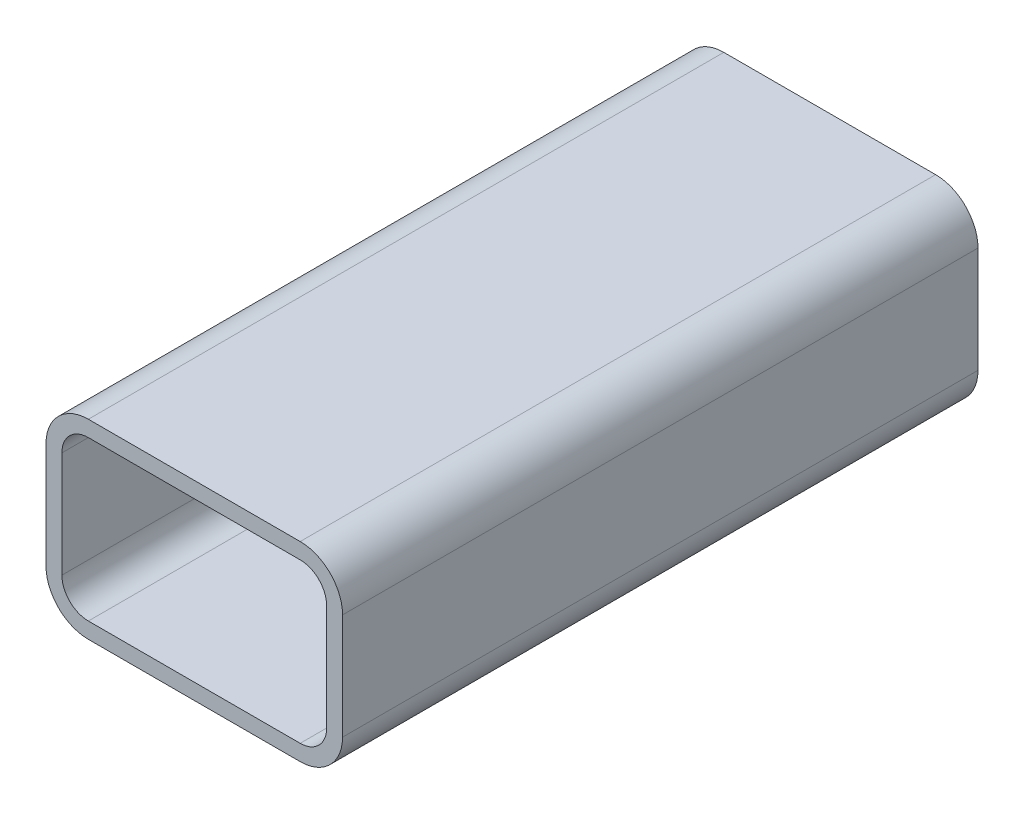
ISO-10303-21;
HEADER;
FILE_DESCRIPTION(('STEP AP214'),'2;1');
FILE_NAME('part.step','',(''),(''),'','','');
FILE_SCHEMA(('AUTOMOTIVE_DESIGN { 1 0 10303 214 1 1 1 1 }'));
ENDSEC;
DATA;
#1=APPLICATION_CONTEXT('core data for automotive mechanical design processes');
#2=APPLICATION_PROTOCOL_DEFINITION('international standard','automotive_design',2000,#1);
#3=PRODUCT_CONTEXT('',#1,'mechanical');
#4=PRODUCT('Part','Part','',(#3));
#5=PRODUCT_RELATED_PRODUCT_CATEGORY('part','',(#4));
#6=PRODUCT_DEFINITION_FORMATION('','',#4);
#7=PRODUCT_DEFINITION_CONTEXT('part definition',#1,'design');
#8=PRODUCT_DEFINITION('design','',#6,#7);
#9=PRODUCT_DEFINITION_SHAPE('','',#8);
#10=(LENGTH_UNIT() NAMED_UNIT(*) SI_UNIT(.MILLI.,.METRE.));
#11=(NAMED_UNIT(*) PLANE_ANGLE_UNIT() SI_UNIT($,.RADIAN.));
#12=(NAMED_UNIT(*) SI_UNIT($,.STERADIAN.) SOLID_ANGLE_UNIT());
#13=UNCERTAINTY_MEASURE_WITH_UNIT(LENGTH_MEASURE(1.E-05),#10,'distance_accuracy_value','');
#14=(GEOMETRIC_REPRESENTATION_CONTEXT(3) GLOBAL_UNCERTAINTY_ASSIGNED_CONTEXT((#13)) GLOBAL_UNIT_ASSIGNED_CONTEXT((#10,
#11,#12)) REPRESENTATION_CONTEXT('',''));
#15=CARTESIAN_POINT('',(0.,0.,0.));
#16=DIRECTION('',(0.,0.,1.));
#17=DIRECTION('',(1.,0.,0.));
#18=AXIS2_PLACEMENT_3D('',#15,#16,#17);
#19=CARTESIAN_POINT('',(20.,10.,60.));
#20=DIRECTION('',(0.,0.,-1.));
#21=DIRECTION('',(-1.,0.,0.));
#22=AXIS2_PLACEMENT_3D('',#19,#20,#21);
#23=PLANE('',#22);
#24=CARTESIAN_POINT('',(20.,10.,60.));
#25=DIRECTION('',(0.,0.,-1.));
#26=DIRECTION('',(-1.,0.,0.));
#27=AXIS2_PLACEMENT_3D('',#24,#25,#26);
#28=CIRCLE('',#27,8.);
#29=CARTESIAN_POINT('',(28.,10.,60.));
#30=VERTEX_POINT('',#29);
#31=CARTESIAN_POINT('',(20.,18.,60.));
#32=VERTEX_POINT('',#31);
#33=EDGE_CURVE('E290',#30,#32,#28,.F.);
#34=ORIENTED_EDGE('',*,*,#33,.T.);
#35=DIRECTION('',(-1.,0.,0.));
#36=VECTOR('',#35,1.);
#37=CARTESIAN_POINT('',(20.,18.,60.));
#38=LINE('',#37,#36);
#39=CARTESIAN_POINT('',(-20.,18.,60.));
#40=VERTEX_POINT('',#39);
#41=EDGE_CURVE('E294',#32,#40,#38,.T.);
#42=ORIENTED_EDGE('',*,*,#41,.T.);
#43=CARTESIAN_POINT('',(-20.,10.,60.));
#44=DIRECTION('',(0.,0.,-1.));
#45=DIRECTION('',(-1.,0.,0.));
#46=AXIS2_PLACEMENT_3D('',#43,#44,#45);
#47=CIRCLE('',#46,8.);
#48=CARTESIAN_POINT('',(-28.,10.,60.));
#49=VERTEX_POINT('',#48);
#50=EDGE_CURVE('E298',#40,#49,#47,.F.);
#51=ORIENTED_EDGE('',*,*,#50,.T.);
#52=DIRECTION('',(0.,-1.,0.));
#53=VECTOR('',#52,1.);
#54=CARTESIAN_POINT('',(-28.,9.99999999999998,60.));
#55=LINE('',#54,#53);
#56=CARTESIAN_POINT('',(-28.,-10.,60.));
#57=VERTEX_POINT('',#56);
#58=EDGE_CURVE('E301',#49,#57,#55,.T.);
#59=ORIENTED_EDGE('',*,*,#58,.T.);
#60=CARTESIAN_POINT('',(-20.,-9.99999999999999,60.));
#61=DIRECTION('',(0.,0.,-1.));
#62=DIRECTION('',(-1.,0.,0.));
#63=AXIS2_PLACEMENT_3D('',#60,#61,#62);
#64=CIRCLE('',#63,8.);
#65=CARTESIAN_POINT('',(-20.,-18.,60.));
#66=VERTEX_POINT('',#65);
#67=EDGE_CURVE('E304',#57,#66,#64,.F.);
#68=ORIENTED_EDGE('',*,*,#67,.T.);
#69=DIRECTION('',(1.,0.,0.));
#70=VECTOR('',#69,1.);
#71=CARTESIAN_POINT('',(20.,-18.,60.));
#72=LINE('',#71,#70);
#73=CARTESIAN_POINT('',(20.,-18.,60.));
#74=VERTEX_POINT('',#73);
#75=EDGE_CURVE('E307',#66,#74,#72,.T.);
#76=ORIENTED_EDGE('',*,*,#75,.T.);
#77=CARTESIAN_POINT('',(20.,-9.99999999999999,60.));
#78=DIRECTION('',(0.,0.,-1.));
#79=DIRECTION('',(-1.,0.,0.));
#80=AXIS2_PLACEMENT_3D('',#77,#78,#79);
#81=CIRCLE('',#80,8.);
#82=CARTESIAN_POINT('',(28.,-9.99999999999999,60.));
#83=VERTEX_POINT('',#82);
#84=EDGE_CURVE('E310',#74,#83,#81,.F.);
#85=ORIENTED_EDGE('',*,*,#84,.T.);
#86=DIRECTION('',(0.,1.,0.));
#87=VECTOR('',#86,1.);
#88=CARTESIAN_POINT('',(28.,10.,60.));
#89=LINE('',#88,#87);
#90=EDGE_CURVE('E313',#83,#30,#89,.T.);
#91=ORIENTED_EDGE('',*,*,#90,.T.);
#92=EDGE_LOOP('',(#34,#42,#51,#59,#68,#76,#85,#91));
#93=FACE_BOUND('',#92,.T.);
#94=CARTESIAN_POINT('',(20.,10.,60.));
#95=DIRECTION('',(0.,0.,1.));
#96=DIRECTION('',(-1.,0.,0.));
#97=AXIS2_PLACEMENT_3D('',#94,#95,#96);
#98=CIRCLE('',#97,5.);
#99=CARTESIAN_POINT('',(25.,10.,60.));
#100=VERTEX_POINT('',#99);
#101=CARTESIAN_POINT('',(20.,15.,60.));
#102=VERTEX_POINT('',#101);
#103=EDGE_CURVE('E201',#100,#102,#98,.T.);
#104=ORIENTED_EDGE('',*,*,#103,.F.);
#105=DIRECTION('',(0.,1.,0.));
#106=VECTOR('',#105,1.);
#107=CARTESIAN_POINT('',(25.,10.,60.));
#108=LINE('',#107,#106);
#109=CARTESIAN_POINT('',(25.,-9.99999999999999,60.));
#110=VERTEX_POINT('',#109);
#111=EDGE_CURVE('E242',#110,#100,#108,.T.);
#112=ORIENTED_EDGE('',*,*,#111,.F.);
#113=CARTESIAN_POINT('',(20.,-9.99999999999999,60.));
#114=DIRECTION('',(0.,0.,1.));
#115=DIRECTION('',(-1.,0.,0.));
#116=AXIS2_PLACEMENT_3D('',#113,#114,#115);
#117=CIRCLE('',#116,5.);
#118=CARTESIAN_POINT('',(20.,-15.,60.));
#119=VERTEX_POINT('',#118);
#120=EDGE_CURVE('E239',#119,#110,#117,.T.);
#121=ORIENTED_EDGE('',*,*,#120,.F.);
#122=DIRECTION('',(1.,0.,0.));
#123=VECTOR('',#122,1.);
#124=CARTESIAN_POINT('',(-20.,-15.,60.));
#125=LINE('',#124,#123);
#126=CARTESIAN_POINT('',(-20.,-15.,60.));
#127=VERTEX_POINT('',#126);
#128=EDGE_CURVE('E236',#127,#119,#125,.T.);
#129=ORIENTED_EDGE('',*,*,#128,.F.);
#130=CARTESIAN_POINT('',(-20.,-9.99999999999999,60.));
#131=DIRECTION('',(0.,0.,1.));
#132=DIRECTION('',(-1.,0.,0.));
#133=AXIS2_PLACEMENT_3D('',#130,#131,#132);
#134=CIRCLE('',#133,5.);
#135=CARTESIAN_POINT('',(-25.,-9.99999999999999,60.));
#136=VERTEX_POINT('',#135);
#137=EDGE_CURVE('E233',#136,#127,#134,.T.);
#138=ORIENTED_EDGE('',*,*,#137,.F.);
#139=DIRECTION('',(0.,-1.,0.));
#140=VECTOR('',#139,1.);
#141=CARTESIAN_POINT('',(-25.,10.,60.));
#142=LINE('',#141,#140);
#143=CARTESIAN_POINT('',(-25.,10.,60.));
#144=VERTEX_POINT('',#143);
#145=EDGE_CURVE('E228',#144,#136,#142,.T.);
#146=ORIENTED_EDGE('',*,*,#145,.F.);
#147=CARTESIAN_POINT('',(-20.,10.,60.));
#148=DIRECTION('',(0.,0.,1.));
#149=DIRECTION('',(-1.,0.,0.));
#150=AXIS2_PLACEMENT_3D('',#147,#148,#149);
#151=CIRCLE('',#150,5.);
#152=CARTESIAN_POINT('',(-20.,15.,60.));
#153=VERTEX_POINT('',#152);
#154=EDGE_CURVE('E224',#153,#144,#151,.T.);
#155=ORIENTED_EDGE('',*,*,#154,.F.);
#156=DIRECTION('',(-1.,0.,0.));
#157=VECTOR('',#156,1.);
#158=CARTESIAN_POINT('',(-20.,15.,60.));
#159=LINE('',#158,#157);
#160=EDGE_CURVE('E210',#102,#153,#159,.T.);
#161=ORIENTED_EDGE('',*,*,#160,.F.);
#162=EDGE_LOOP('',(#104,#112,#121,#129,#138,#146,#155,#161));
#163=FACE_BOUND('',#162,.T.);
#164=ADVANCED_FACE('F87',(#93,#163),#23,.F.);
#165=CARTESIAN_POINT('',(20.,10.,-60.));
#166=DIRECTION('',(0.,0.,-1.));
#167=DIRECTION('',(-1.,0.,0.));
#168=AXIS2_PLACEMENT_3D('',#165,#166,#167);
#169=PLANE('',#168);
#170=CARTESIAN_POINT('',(20.,10.,-60.));
#171=DIRECTION('',(0.,0.,-1.));
#172=DIRECTION('',(-1.,0.,0.));
#173=AXIS2_PLACEMENT_3D('',#170,#171,#172);
#174=CIRCLE('',#173,8.);
#175=CARTESIAN_POINT('',(28.,10.,-60.));
#176=VERTEX_POINT('',#175);
#177=CARTESIAN_POINT('',(20.,18.,-60.));
#178=VERTEX_POINT('',#177);
#179=EDGE_CURVE('E219',#176,#178,#174,.F.);
#180=ORIENTED_EDGE('',*,*,#179,.F.);
#181=DIRECTION('',(0.,1.,0.));
#182=VECTOR('',#181,1.);
#183=CARTESIAN_POINT('',(28.,10.,-60.));
#184=LINE('',#183,#182);
#185=CARTESIAN_POINT('',(28.,-9.99999999999999,-60.));
#186=VERTEX_POINT('',#185);
#187=EDGE_CURVE('E295',#186,#176,#184,.T.);
#188=ORIENTED_EDGE('',*,*,#187,.F.);
#189=CARTESIAN_POINT('',(20.,-9.99999999999999,-60.));
#190=DIRECTION('',(0.,0.,-1.));
#191=DIRECTION('',(-1.,0.,0.));
#192=AXIS2_PLACEMENT_3D('',#189,#190,#191);
#193=CIRCLE('',#192,8.);
#194=CARTESIAN_POINT('',(20.,-18.,-60.));
#195=VERTEX_POINT('',#194);
#196=EDGE_CURVE('E335',#195,#186,#193,.F.);
#197=ORIENTED_EDGE('',*,*,#196,.F.);
#198=DIRECTION('',(1.,0.,0.));
#199=VECTOR('',#198,1.);
#200=CARTESIAN_POINT('',(20.,-18.,-60.));
#201=LINE('',#200,#199);
#202=CARTESIAN_POINT('',(-20.,-18.,-60.));
#203=VERTEX_POINT('',#202);
#204=EDGE_CURVE('E332',#203,#195,#201,.T.);
#205=ORIENTED_EDGE('',*,*,#204,.F.);
#206=CARTESIAN_POINT('',(-20.,-9.99999999999999,-60.));
#207=DIRECTION('',(0.,0.,-1.));
#208=DIRECTION('',(-1.,0.,0.));
#209=AXIS2_PLACEMENT_3D('',#206,#207,#208);
#210=CIRCLE('',#209,8.);
#211=CARTESIAN_POINT('',(-28.,-10.,-60.));
#212=VERTEX_POINT('',#211);
#213=EDGE_CURVE('E329',#212,#203,#210,.F.);
#214=ORIENTED_EDGE('',*,*,#213,.F.);
#215=DIRECTION('',(0.,-1.,0.));
#216=VECTOR('',#215,1.);
#217=CARTESIAN_POINT('',(-28.,9.99999999999998,-60.));
#218=LINE('',#217,#216);
#219=CARTESIAN_POINT('',(-28.,10.,-60.));
#220=VERTEX_POINT('',#219);
#221=EDGE_CURVE('E326',#220,#212,#218,.T.);
#222=ORIENTED_EDGE('',*,*,#221,.F.);
#223=CARTESIAN_POINT('',(-20.,10.,-60.));
#224=DIRECTION('',(0.,0.,-1.));
#225=DIRECTION('',(-1.,0.,0.));
#226=AXIS2_PLACEMENT_3D('',#223,#224,#225);
#227=CIRCLE('',#226,8.);
#228=CARTESIAN_POINT('',(-20.,18.,-60.));
#229=VERTEX_POINT('',#228);
#230=EDGE_CURVE('E323',#229,#220,#227,.F.);
#231=ORIENTED_EDGE('',*,*,#230,.F.);
#232=DIRECTION('',(-1.,0.,0.));
#233=VECTOR('',#232,1.);
#234=CARTESIAN_POINT('',(20.,18.,-60.));
#235=LINE('',#234,#233);
#236=EDGE_CURVE('E320',#178,#229,#235,.T.);
#237=ORIENTED_EDGE('',*,*,#236,.F.);
#238=EDGE_LOOP('',(#180,#188,#197,#205,#214,#222,#231,#237));
#239=FACE_BOUND('',#238,.T.);
#240=DIRECTION('',(0.,1.,0.));
#241=VECTOR('',#240,1.);
#242=CARTESIAN_POINT('',(25.,10.,-60.));
#243=LINE('',#242,#241);
#244=CARTESIAN_POINT('',(25.,-9.99999999999999,-60.));
#245=VERTEX_POINT('',#244);
#246=CARTESIAN_POINT('',(25.,10.,-60.));
#247=VERTEX_POINT('',#246);
#248=EDGE_CURVE('E211',#245,#247,#243,.T.);
#249=ORIENTED_EDGE('',*,*,#248,.T.);
#250=CARTESIAN_POINT('',(20.,10.,-60.));
#251=DIRECTION('',(0.,0.,1.));
#252=DIRECTION('',(-1.,0.,0.));
#253=AXIS2_PLACEMENT_3D('',#250,#251,#252);
#254=CIRCLE('',#253,5.);
#255=CARTESIAN_POINT('',(20.,15.,-60.));
#256=VERTEX_POINT('',#255);
#257=EDGE_CURVE('E111',#247,#256,#254,.T.);
#258=ORIENTED_EDGE('',*,*,#257,.T.);
#259=DIRECTION('',(-1.,0.,0.));
#260=VECTOR('',#259,1.);
#261=CARTESIAN_POINT('',(-20.,15.,-60.));
#262=LINE('',#261,#260);
#263=CARTESIAN_POINT('',(-20.,15.,-60.));
#264=VERTEX_POINT('',#263);
#265=EDGE_CURVE('E217',#256,#264,#262,.T.);
#266=ORIENTED_EDGE('',*,*,#265,.T.);
#267=CARTESIAN_POINT('',(-20.,10.,-60.));
#268=DIRECTION('',(0.,0.,1.));
#269=DIRECTION('',(-1.,0.,0.));
#270=AXIS2_PLACEMENT_3D('',#267,#268,#269);
#271=CIRCLE('',#270,5.);
#272=CARTESIAN_POINT('',(-25.,10.,-60.));
#273=VERTEX_POINT('',#272);
#274=EDGE_CURVE('E249',#264,#273,#271,.T.);
#275=ORIENTED_EDGE('',*,*,#274,.T.);
#276=DIRECTION('',(0.,-1.,0.));
#277=VECTOR('',#276,1.);
#278=CARTESIAN_POINT('',(-25.,10.,-60.));
#279=LINE('',#278,#277);
#280=CARTESIAN_POINT('',(-25.,-9.99999999999999,-60.));
#281=VERTEX_POINT('',#280);
#282=EDGE_CURVE('E253',#273,#281,#279,.T.);
#283=ORIENTED_EDGE('',*,*,#282,.T.);
#284=CARTESIAN_POINT('',(-20.,-9.99999999999999,-60.));
#285=DIRECTION('',(0.,0.,1.));
#286=DIRECTION('',(-1.,0.,0.));
#287=AXIS2_PLACEMENT_3D('',#284,#285,#286);
#288=CIRCLE('',#287,5.);
#289=CARTESIAN_POINT('',(-20.,-15.,-60.));
#290=VERTEX_POINT('',#289);
#291=EDGE_CURVE('E257',#281,#290,#288,.T.);
#292=ORIENTED_EDGE('',*,*,#291,.T.);
#293=DIRECTION('',(1.,0.,0.));
#294=VECTOR('',#293,1.);
#295=CARTESIAN_POINT('',(-20.,-15.,-60.));
#296=LINE('',#295,#294);
#297=CARTESIAN_POINT('',(20.,-15.,-60.));
#298=VERTEX_POINT('',#297);
#299=EDGE_CURVE('E261',#290,#298,#296,.T.);
#300=ORIENTED_EDGE('',*,*,#299,.T.);
#301=CARTESIAN_POINT('',(20.,-9.99999999999999,-60.));
#302=DIRECTION('',(0.,0.,1.));
#303=DIRECTION('',(-1.,0.,0.));
#304=AXIS2_PLACEMENT_3D('',#301,#302,#303);
#305=CIRCLE('',#304,5.);
#306=EDGE_CURVE('E265',#298,#245,#305,.T.);
#307=ORIENTED_EDGE('',*,*,#306,.T.);
#308=EDGE_LOOP('',(#249,#258,#266,#275,#283,#292,#300,#307));
#309=FACE_BOUND('',#308,.T.);
#310=ADVANCED_FACE('F374',(#239,#309),#169,.T.);
#311=CARTESIAN_POINT('',(20.,10.,60.));
#312=DIRECTION('',(0.,0.,-1.));
#313=DIRECTION('',(-1.,0.,0.));
#314=AXIS2_PLACEMENT_3D('',#311,#312,#313);
#315=CYLINDRICAL_SURFACE('',#314,8.);
#316=ORIENTED_EDGE('',*,*,#179,.T.);
#317=DIRECTION('',(0.,0.,-1.));
#318=VECTOR('',#317,1.);
#319=CARTESIAN_POINT('',(20.,18.,60.));
#320=LINE('',#319,#318);
#321=EDGE_CURVE('E12',#32,#178,#320,.T.);
#322=ORIENTED_EDGE('',*,*,#321,.F.);
#323=ORIENTED_EDGE('',*,*,#33,.F.);
#324=DIRECTION('',(0.,0.,-1.));
#325=VECTOR('',#324,1.);
#326=CARTESIAN_POINT('',(28.,10.,60.));
#327=LINE('',#326,#325);
#328=EDGE_CURVE('E316',#30,#176,#327,.T.);
#329=ORIENTED_EDGE('',*,*,#328,.T.);
#330=EDGE_LOOP('',(#316,#322,#323,#329));
#331=FACE_BOUND('',#330,.T.);
#332=ADVANCED_FACE('F89',(#331),#315,.T.);
#333=CARTESIAN_POINT('',(20.,18.,60.));
#334=DIRECTION('',(0.,-1.,0.));
#335=DIRECTION('',(0.,0.,-1.));
#336=AXIS2_PLACEMENT_3D('',#333,#334,#335);
#337=PLANE('',#336);
#338=ORIENTED_EDGE('',*,*,#236,.T.);
#339=DIRECTION('',(0.,0.,-1.));
#340=VECTOR('',#339,1.);
#341=CARTESIAN_POINT('',(-20.,18.,60.));
#342=LINE('',#341,#340);
#343=EDGE_CURVE('E96',#40,#229,#342,.T.);
#344=ORIENTED_EDGE('',*,*,#343,.F.);
#345=ORIENTED_EDGE('',*,*,#41,.F.);
#346=ORIENTED_EDGE('',*,*,#321,.T.);
#347=EDGE_LOOP('',(#338,#344,#345,#346));
#348=FACE_BOUND('',#347,.T.);
#349=ADVANCED_FACE('F391',(#348),#337,.F.);
#350=CARTESIAN_POINT('',(-20.,10.,60.));
#351=DIRECTION('',(0.,0.,-1.));
#352=DIRECTION('',(-1.,0.,0.));
#353=AXIS2_PLACEMENT_3D('',#350,#351,#352);
#354=CYLINDRICAL_SURFACE('',#353,8.);
#355=ORIENTED_EDGE('',*,*,#230,.T.);
#356=DIRECTION('',(0.,0.,-1.));
#357=VECTOR('',#356,1.);
#358=CARTESIAN_POINT('',(-28.,10.,60.));
#359=LINE('',#358,#357);
#360=EDGE_CURVE('E359',#49,#220,#359,.T.);
#361=ORIENTED_EDGE('',*,*,#360,.F.);
#362=ORIENTED_EDGE('',*,*,#50,.F.);
#363=ORIENTED_EDGE('',*,*,#343,.T.);
#364=EDGE_LOOP('',(#355,#361,#362,#363));
#365=FACE_BOUND('',#364,.T.);
#366=ADVANCED_FACE('F368',(#365),#354,.T.);
#367=CARTESIAN_POINT('',(-28.,9.99999999999998,60.));
#368=DIRECTION('',(1.,0.,0.));
#369=DIRECTION('',(0.,1.,0.));
#370=AXIS2_PLACEMENT_3D('',#367,#368,#369);
#371=PLANE('',#370);
#372=ORIENTED_EDGE('',*,*,#221,.T.);
#373=DIRECTION('',(0.,0.,-1.));
#374=VECTOR('',#373,1.);
#375=CARTESIAN_POINT('',(-28.,-10.,60.));
#376=LINE('',#375,#374);
#377=EDGE_CURVE('E355',#57,#212,#376,.T.);
#378=ORIENTED_EDGE('',*,*,#377,.F.);
#379=ORIENTED_EDGE('',*,*,#58,.F.);
#380=ORIENTED_EDGE('',*,*,#360,.T.);
#381=EDGE_LOOP('',(#372,#378,#379,#380));
#382=FACE_BOUND('',#381,.T.);
#383=ADVANCED_FACE('F380',(#382),#371,.F.);
#384=CARTESIAN_POINT('',(-20.,-9.99999999999999,60.));
#385=DIRECTION('',(0.,0.,-1.));
#386=DIRECTION('',(-1.,0.,0.));
#387=AXIS2_PLACEMENT_3D('',#384,#385,#386);
#388=CYLINDRICAL_SURFACE('',#387,8.);
#389=ORIENTED_EDGE('',*,*,#213,.T.);
#390=DIRECTION('',(0.,0.,-1.));
#391=VECTOR('',#390,1.);
#392=CARTESIAN_POINT('',(-20.,-18.,60.));
#393=LINE('',#392,#391);
#394=EDGE_CURVE('E351',#66,#203,#393,.T.);
#395=ORIENTED_EDGE('',*,*,#394,.F.);
#396=ORIENTED_EDGE('',*,*,#67,.F.);
#397=ORIENTED_EDGE('',*,*,#377,.T.);
#398=EDGE_LOOP('',(#389,#395,#396,#397));
#399=FACE_BOUND('',#398,.T.);
#400=ADVANCED_FACE('F384',(#399),#388,.T.);
#401=CARTESIAN_POINT('',(20.,-18.,60.));
#402=DIRECTION('',(0.,1.,0.));
#403=DIRECTION('',(0.,0.,1.));
#404=AXIS2_PLACEMENT_3D('',#401,#402,#403);
#405=PLANE('',#404);
#406=ORIENTED_EDGE('',*,*,#204,.T.);
#407=DIRECTION('',(0.,0.,-1.));
#408=VECTOR('',#407,1.);
#409=CARTESIAN_POINT('',(20.,-18.,60.));
#410=LINE('',#409,#408);
#411=EDGE_CURVE('E347',#74,#195,#410,.T.);
#412=ORIENTED_EDGE('',*,*,#411,.F.);
#413=ORIENTED_EDGE('',*,*,#75,.F.);
#414=ORIENTED_EDGE('',*,*,#394,.T.);
#415=EDGE_LOOP('',(#406,#412,#413,#414));
#416=FACE_BOUND('',#415,.T.);
#417=ADVANCED_FACE('F404',(#416),#405,.F.);
#418=CARTESIAN_POINT('',(20.,-9.99999999999999,60.));
#419=DIRECTION('',(0.,0.,-1.));
#420=DIRECTION('',(-1.,0.,0.));
#421=AXIS2_PLACEMENT_3D('',#418,#419,#420);
#422=CYLINDRICAL_SURFACE('',#421,8.);
#423=ORIENTED_EDGE('',*,*,#196,.T.);
#424=DIRECTION('',(0.,0.,-1.));
#425=VECTOR('',#424,1.);
#426=CARTESIAN_POINT('',(28.,-9.99999999999999,60.));
#427=LINE('',#426,#425);
#428=EDGE_CURVE('E343',#83,#186,#427,.T.);
#429=ORIENTED_EDGE('',*,*,#428,.F.);
#430=ORIENTED_EDGE('',*,*,#84,.F.);
#431=ORIENTED_EDGE('',*,*,#411,.T.);
#432=EDGE_LOOP('',(#423,#429,#430,#431));
#433=FACE_BOUND('',#432,.T.);
#434=ADVANCED_FACE('F402',(#433),#422,.T.);
#435=CARTESIAN_POINT('',(28.,10.,60.));
#436=DIRECTION('',(-1.,0.,0.));
#437=DIRECTION('',(0.,-1.,0.));
#438=AXIS2_PLACEMENT_3D('',#435,#436,#437);
#439=PLANE('',#438);
#440=ORIENTED_EDGE('',*,*,#187,.T.);
#441=ORIENTED_EDGE('',*,*,#328,.F.);
#442=ORIENTED_EDGE('',*,*,#90,.F.);
#443=ORIENTED_EDGE('',*,*,#428,.T.);
#444=EDGE_LOOP('',(#440,#441,#442,#443));
#445=FACE_BOUND('',#444,.T.);
#446=ADVANCED_FACE('F397',(#445),#439,.F.);
#447=CARTESIAN_POINT('',(20.,10.,60.));
#448=DIRECTION('',(0.,0.,-1.));
#449=DIRECTION('',(-1.,0.,0.));
#450=AXIS2_PLACEMENT_3D('',#447,#448,#449);
#451=CYLINDRICAL_SURFACE('',#450,5.);
#452=ORIENTED_EDGE('',*,*,#257,.F.);
#453=DIRECTION('',(0.,0.,-1.));
#454=VECTOR('',#453,1.);
#455=CARTESIAN_POINT('',(25.,10.,60.));
#456=LINE('',#455,#454);
#457=EDGE_CURVE('E205',#100,#247,#456,.T.);
#458=ORIENTED_EDGE('',*,*,#457,.F.);
#459=ORIENTED_EDGE('',*,*,#103,.T.);
#460=DIRECTION('',(0.,0.,-1.));
#461=VECTOR('',#460,1.);
#462=CARTESIAN_POINT('',(20.,15.,60.));
#463=LINE('',#462,#461);
#464=EDGE_CURVE('E204',#102,#256,#463,.T.);
#465=ORIENTED_EDGE('',*,*,#464,.T.);
#466=EDGE_LOOP('',(#452,#458,#459,#465));
#467=FACE_BOUND('',#466,.T.);
#468=ADVANCED_FACE('F203',(#467),#451,.F.);
#469=CARTESIAN_POINT('',(-20.,15.,60.));
#470=DIRECTION('',(0.,-1.,0.));
#471=DIRECTION('',(0.,0.,-1.));
#472=AXIS2_PLACEMENT_3D('',#469,#470,#471);
#473=PLANE('',#472);
#474=ORIENTED_EDGE('',*,*,#265,.F.);
#475=ORIENTED_EDGE('',*,*,#464,.F.);
#476=ORIENTED_EDGE('',*,*,#160,.T.);
#477=DIRECTION('',(0.,0.,-1.));
#478=VECTOR('',#477,1.);
#479=CARTESIAN_POINT('',(-20.,15.,60.));
#480=LINE('',#479,#478);
#481=EDGE_CURVE('E220',#153,#264,#480,.T.);
#482=ORIENTED_EDGE('',*,*,#481,.T.);
#483=EDGE_LOOP('',(#474,#475,#476,#482));
#484=FACE_BOUND('',#483,.T.);
#485=ADVANCED_FACE('F214',(#484),#473,.T.);
#486=CARTESIAN_POINT('',(-20.,10.,60.));
#487=DIRECTION('',(0.,0.,-1.));
#488=DIRECTION('',(-1.,0.,0.));
#489=AXIS2_PLACEMENT_3D('',#486,#487,#488);
#490=CYLINDRICAL_SURFACE('',#489,5.);
#491=ORIENTED_EDGE('',*,*,#274,.F.);
#492=ORIENTED_EDGE('',*,*,#481,.F.);
#493=ORIENTED_EDGE('',*,*,#154,.T.);
#494=DIRECTION('',(0.,0.,-1.));
#495=VECTOR('',#494,1.);
#496=CARTESIAN_POINT('',(-25.,10.,60.));
#497=LINE('',#496,#495);
#498=EDGE_CURVE('E285',#144,#273,#497,.T.);
#499=ORIENTED_EDGE('',*,*,#498,.T.);
#500=EDGE_LOOP('',(#491,#492,#493,#499));
#501=FACE_BOUND('',#500,.T.);
#502=ADVANCED_FACE('F429',(#501),#490,.F.);
#503=CARTESIAN_POINT('',(-25.,10.,60.));
#504=DIRECTION('',(1.,0.,0.));
#505=DIRECTION('',(0.,1.,0.));
#506=AXIS2_PLACEMENT_3D('',#503,#504,#505);
#507=PLANE('',#506);
#508=ORIENTED_EDGE('',*,*,#282,.F.);
#509=ORIENTED_EDGE('',*,*,#498,.F.);
#510=ORIENTED_EDGE('',*,*,#145,.T.);
#511=DIRECTION('',(0.,0.,-1.));
#512=VECTOR('',#511,1.);
#513=CARTESIAN_POINT('',(-25.,-9.99999999999999,60.));
#514=LINE('',#513,#512);
#515=EDGE_CURVE('E282',#136,#281,#514,.T.);
#516=ORIENTED_EDGE('',*,*,#515,.T.);
#517=EDGE_LOOP('',(#508,#509,#510,#516));
#518=FACE_BOUND('',#517,.T.);
#519=ADVANCED_FACE('F433',(#518),#507,.T.);
#520=CARTESIAN_POINT('',(-20.,-9.99999999999999,60.));
#521=DIRECTION('',(0.,0.,-1.));
#522=DIRECTION('',(-1.,0.,0.));
#523=AXIS2_PLACEMENT_3D('',#520,#521,#522);
#524=CYLINDRICAL_SURFACE('',#523,5.);
#525=ORIENTED_EDGE('',*,*,#291,.F.);
#526=ORIENTED_EDGE('',*,*,#515,.F.);
#527=ORIENTED_EDGE('',*,*,#137,.T.);
#528=DIRECTION('',(0.,0.,-1.));
#529=VECTOR('',#528,1.);
#530=CARTESIAN_POINT('',(-20.,-15.,60.));
#531=LINE('',#530,#529);
#532=EDGE_CURVE('E279',#127,#290,#531,.T.);
#533=ORIENTED_EDGE('',*,*,#532,.T.);
#534=EDGE_LOOP('',(#525,#526,#527,#533));
#535=FACE_BOUND('',#534,.T.);
#536=ADVANCED_FACE('F439',(#535),#524,.F.);
#537=CARTESIAN_POINT('',(-20.,-15.,60.));
#538=DIRECTION('',(0.,1.,0.));
#539=DIRECTION('',(0.,0.,1.));
#540=AXIS2_PLACEMENT_3D('',#537,#538,#539);
#541=PLANE('',#540);
#542=ORIENTED_EDGE('',*,*,#299,.F.);
#543=ORIENTED_EDGE('',*,*,#532,.F.);
#544=ORIENTED_EDGE('',*,*,#128,.T.);
#545=DIRECTION('',(0.,0.,-1.));
#546=VECTOR('',#545,1.);
#547=CARTESIAN_POINT('',(20.,-15.,60.));
#548=LINE('',#547,#546);
#549=EDGE_CURVE('E276',#119,#298,#548,.T.);
#550=ORIENTED_EDGE('',*,*,#549,.T.);
#551=EDGE_LOOP('',(#542,#543,#544,#550));
#552=FACE_BOUND('',#551,.T.);
#553=ADVANCED_FACE('F443',(#552),#541,.T.);
#554=CARTESIAN_POINT('',(20.,-9.99999999999999,60.));
#555=DIRECTION('',(0.,0.,-1.));
#556=DIRECTION('',(-1.,0.,0.));
#557=AXIS2_PLACEMENT_3D('',#554,#555,#556);
#558=CYLINDRICAL_SURFACE('',#557,5.);
#559=ORIENTED_EDGE('',*,*,#306,.F.);
#560=ORIENTED_EDGE('',*,*,#549,.F.);
#561=ORIENTED_EDGE('',*,*,#120,.T.);
#562=DIRECTION('',(0.,0.,-1.));
#563=VECTOR('',#562,1.);
#564=CARTESIAN_POINT('',(25.,-9.99999999999999,60.));
#565=LINE('',#564,#563);
#566=EDGE_CURVE('E103',#110,#245,#565,.T.);
#567=ORIENTED_EDGE('',*,*,#566,.T.);
#568=EDGE_LOOP('',(#559,#560,#561,#567));
#569=FACE_BOUND('',#568,.T.);
#570=ADVANCED_FACE('F447',(#569),#558,.F.);
#571=CARTESIAN_POINT('',(25.,10.,60.));
#572=DIRECTION('',(-1.,0.,0.));
#573=DIRECTION('',(0.,-1.,0.));
#574=AXIS2_PLACEMENT_3D('',#571,#572,#573);
#575=PLANE('',#574);
#576=ORIENTED_EDGE('',*,*,#248,.F.);
#577=ORIENTED_EDGE('',*,*,#566,.F.);
#578=ORIENTED_EDGE('',*,*,#111,.T.);
#579=ORIENTED_EDGE('',*,*,#457,.T.);
#580=EDGE_LOOP('',(#576,#577,#578,#579));
#581=FACE_BOUND('',#580,.T.);
#582=ADVANCED_FACE('F451',(#581),#575,.T.);
#583=CLOSED_SHELL('',(#164,#310,#332,#349,#366,#383,#400,#417,#434,#446,#468,#485,#502,#519,
#536,#553,#570,#582));
#584=MANIFOLD_SOLID_BREP('B2',#583);
#585=ADVANCED_BREP_SHAPE_REPRESENTATION('',(#18,#584),#14);
#586=SHAPE_DEFINITION_REPRESENTATION(#9,#585);
ENDSEC;
END-ISO-10303-21;
